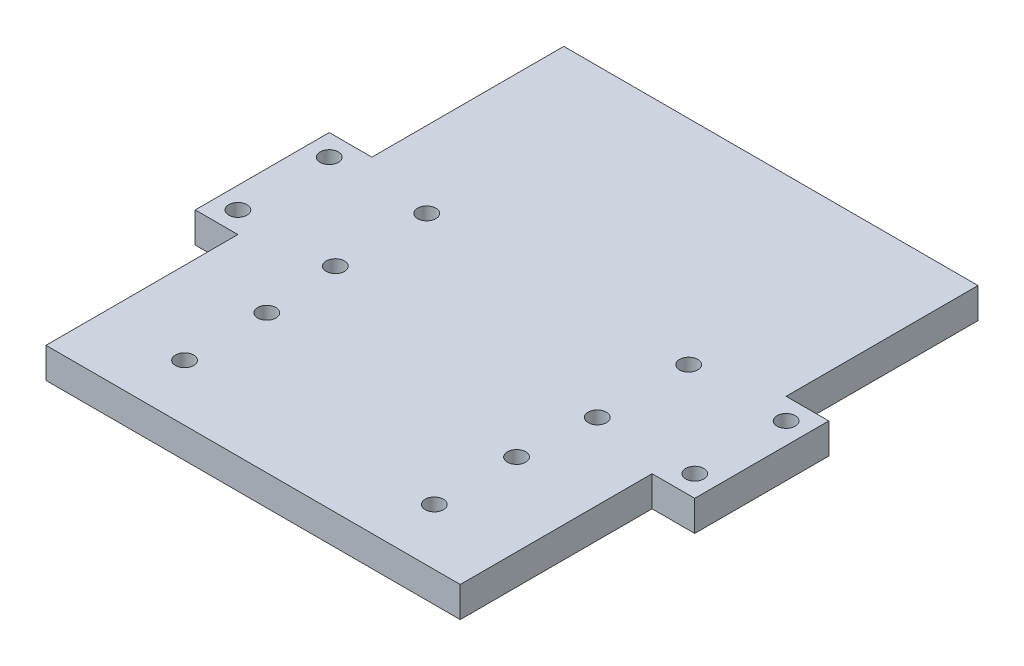
ISO-10303-21;
HEADER;
FILE_DESCRIPTION(('STEP AP214'),'2;1');
FILE_NAME('part.step','',(''),(''),'','','');
FILE_SCHEMA(('AUTOMOTIVE_DESIGN { 1 0 10303 214 1 1 1 1 }'));
ENDSEC;
DATA;
#1=APPLICATION_CONTEXT('core data for automotive mechanical design processes');
#2=APPLICATION_PROTOCOL_DEFINITION('international standard','automotive_design',2000,#1);
#3=PRODUCT_CONTEXT('',#1,'mechanical');
#4=PRODUCT('Part','Part','',(#3));
#5=PRODUCT_RELATED_PRODUCT_CATEGORY('part','',(#4));
#6=PRODUCT_DEFINITION_FORMATION('','',#4);
#7=PRODUCT_DEFINITION_CONTEXT('part definition',#1,'design');
#8=PRODUCT_DEFINITION('design','',#6,#7);
#9=PRODUCT_DEFINITION_SHAPE('','',#8);
#10=(LENGTH_UNIT() NAMED_UNIT(*) SI_UNIT(.MILLI.,.METRE.));
#11=(NAMED_UNIT(*) PLANE_ANGLE_UNIT() SI_UNIT($,.RADIAN.));
#12=(NAMED_UNIT(*) SI_UNIT($,.STERADIAN.) SOLID_ANGLE_UNIT());
#13=UNCERTAINTY_MEASURE_WITH_UNIT(LENGTH_MEASURE(1.E-05),#10,'distance_accuracy_value','');
#14=(GEOMETRIC_REPRESENTATION_CONTEXT(3) GLOBAL_UNCERTAINTY_ASSIGNED_CONTEXT((#13)) GLOBAL_UNIT_ASSIGNED_CONTEXT((#10,
#11,#12)) REPRESENTATION_CONTEXT('',''));
#15=CARTESIAN_POINT('',(0.,0.,0.));
#16=DIRECTION('',(0.,0.,1.));
#17=DIRECTION('',(1.,0.,0.));
#18=AXIS2_PLACEMENT_3D('',#15,#16,#17);
#19=CARTESIAN_POINT('',(0.,5.,0.));
#20=DIRECTION('',(0.,-1.,0.));
#21=DIRECTION('',(0.,0.,-1.));
#22=AXIS2_PLACEMENT_3D('',#19,#20,#21);
#23=PLANE('',#22);
#24=CARTESIAN_POINT('',(-20.5,5.,19.75));
#25=DIRECTION('',(0.,1.,0.));
#26=DIRECTION('',(0.,0.,1.));
#27=AXIS2_PLACEMENT_3D('',#24,#25,#26);
#28=CIRCLE('',#27,1.5);
#29=CARTESIAN_POINT('',(-20.5,5.,21.25));
#30=VERTEX_POINT('',#29);
#31=EDGE_CURVE('E368',#30,#30,#28,.T.);
#32=ORIENTED_EDGE('',*,*,#31,.F.);
#33=EDGE_LOOP('',(#32));
#34=FACE_BOUND('',#33,.T.);
#35=CARTESIAN_POINT('',(20.5,5.,33.25));
#36=DIRECTION('',(0.,1.,0.));
#37=DIRECTION('',(0.,0.,-1.));
#38=AXIS2_PLACEMENT_3D('',#35,#36,#37);
#39=CIRCLE('',#38,1.5);
#40=CARTESIAN_POINT('',(20.5,5.,31.75));
#41=VERTEX_POINT('',#40);
#42=EDGE_CURVE('E371',#41,#41,#39,.T.);
#43=ORIENTED_EDGE('',*,*,#42,.F.);
#44=EDGE_LOOP('',(#43));
#45=FACE_BOUND('',#44,.T.);
#46=CARTESIAN_POINT('',(20.5,5.,19.75));
#47=DIRECTION('',(0.,1.,0.));
#48=DIRECTION('',(0.,0.,-1.));
#49=AXIS2_PLACEMENT_3D('',#46,#47,#48);
#50=CIRCLE('',#49,1.5);
#51=CARTESIAN_POINT('',(20.5,5.,18.25));
#52=VERTEX_POINT('',#51);
#53=EDGE_CURVE('E377',#52,#52,#50,.T.);
#54=ORIENTED_EDGE('',*,*,#53,.F.);
#55=EDGE_LOOP('',(#54));
#56=FACE_BOUND('',#55,.T.);
#57=CARTESIAN_POINT('',(-20.5,5.,33.25));
#58=DIRECTION('',(0.,1.,0.));
#59=DIRECTION('',(0.,0.,1.));
#60=AXIS2_PLACEMENT_3D('',#57,#58,#59);
#61=CIRCLE('',#60,1.5);
#62=CARTESIAN_POINT('',(-20.5,5.,34.75));
#63=VERTEX_POINT('',#62);
#64=EDGE_CURVE('E173',#63,#63,#61,.T.);
#65=ORIENTED_EDGE('',*,*,#64,.F.);
#66=EDGE_LOOP('',(#65));
#67=FACE_BOUND('',#66,.T.);
#68=DIRECTION('',(-1.,0.,0.));
#69=VECTOR('',#68,1.);
#70=CARTESIAN_POINT('',(40.,5.,-11.));
#71=LINE('',#70,#69);
#72=CARTESIAN_POINT('',(41.,5.,-11.));
#73=VERTEX_POINT('',#72);
#74=CARTESIAN_POINT('',(34.,5.,-11.));
#75=VERTEX_POINT('',#74);
#76=EDGE_CURVE('E273',#73,#75,#71,.T.);
#77=ORIENTED_EDGE('',*,*,#76,.T.);
#78=DIRECTION('',(0.,0.,1.));
#79=VECTOR('',#78,1.);
#80=CARTESIAN_POINT('',(34.,5.,42.5));
#81=LINE('',#80,#79);
#82=CARTESIAN_POINT('',(34.,5.,-42.5));
#83=VERTEX_POINT('',#82);
#84=EDGE_CURVE('E63',#83,#75,#81,.T.);
#85=ORIENTED_EDGE('',*,*,#84,.F.);
#86=DIRECTION('',(-1.,0.,0.));
#87=VECTOR('',#86,1.);
#88=CARTESIAN_POINT('',(-33.,5.,-42.5));
#89=LINE('',#88,#87);
#90=CARTESIAN_POINT('',(-34.,5.,-42.5));
#91=VERTEX_POINT('',#90);
#92=EDGE_CURVE('E147',#83,#91,#89,.T.);
#93=ORIENTED_EDGE('',*,*,#92,.T.);
#94=DIRECTION('',(0.,0.,-1.));
#95=VECTOR('',#94,1.);
#96=CARTESIAN_POINT('',(-34.,5.,-42.5));
#97=LINE('',#96,#95);
#98=CARTESIAN_POINT('',(-34.,5.,-11.));
#99=VERTEX_POINT('',#98);
#100=EDGE_CURVE('E194',#99,#91,#97,.T.);
#101=ORIENTED_EDGE('',*,*,#100,.F.);
#102=DIRECTION('',(1.,0.,0.));
#103=VECTOR('',#102,1.);
#104=CARTESIAN_POINT('',(-40.,5.,-11.));
#105=LINE('',#104,#103);
#106=CARTESIAN_POINT('',(-41.,5.,-11.));
#107=VERTEX_POINT('',#106);
#108=EDGE_CURVE('E285',#107,#99,#105,.T.);
#109=ORIENTED_EDGE('',*,*,#108,.F.);
#110=DIRECTION('',(0.,0.,-1.));
#111=VECTOR('',#110,1.);
#112=CARTESIAN_POINT('',(-41.,5.,-11.));
#113=LINE('',#112,#111);
#114=CARTESIAN_POINT('',(-41.,5.,11.));
#115=VERTEX_POINT('',#114);
#116=EDGE_CURVE('E230',#115,#107,#113,.T.);
#117=ORIENTED_EDGE('',*,*,#116,.F.);
#118=DIRECTION('',(1.,0.,0.));
#119=VECTOR('',#118,1.);
#120=CARTESIAN_POINT('',(-40.,5.,11.));
#121=LINE('',#120,#119);
#122=CARTESIAN_POINT('',(-34.,5.,11.));
#123=VERTEX_POINT('',#122);
#124=EDGE_CURVE('E288',#115,#123,#121,.T.);
#125=ORIENTED_EDGE('',*,*,#124,.T.);
#126=CARTESIAN_POINT('',(-34.,5.,42.5));
#127=VERTEX_POINT('',#126);
#128=EDGE_CURVE('E195',#127,#123,#97,.T.);
#129=ORIENTED_EDGE('',*,*,#128,.F.);
#130=DIRECTION('',(1.,0.,0.));
#131=VECTOR('',#130,1.);
#132=CARTESIAN_POINT('',(-33.,5.,42.5));
#133=LINE('',#132,#131);
#134=CARTESIAN_POINT('',(34.,5.,42.5));
#135=VERTEX_POINT('',#134);
#136=EDGE_CURVE('E298',#127,#135,#133,.T.);
#137=ORIENTED_EDGE('',*,*,#136,.T.);
#138=CARTESIAN_POINT('',(34.,5.,11.));
#139=VERTEX_POINT('',#138);
#140=EDGE_CURVE('E164',#139,#135,#81,.T.);
#141=ORIENTED_EDGE('',*,*,#140,.F.);
#142=DIRECTION('',(-1.,0.,0.));
#143=VECTOR('',#142,1.);
#144=CARTESIAN_POINT('',(40.,5.,11.));
#145=LINE('',#144,#143);
#146=CARTESIAN_POINT('',(41.,5.,11.));
#147=VERTEX_POINT('',#146);
#148=EDGE_CURVE('E269',#147,#139,#145,.T.);
#149=ORIENTED_EDGE('',*,*,#148,.F.);
#150=DIRECTION('',(0.,0.,1.));
#151=VECTOR('',#150,1.);
#152=CARTESIAN_POINT('',(41.,5.,11.));
#153=LINE('',#152,#151);
#154=EDGE_CURVE('E214',#73,#147,#153,.T.);
#155=ORIENTED_EDGE('',*,*,#154,.F.);
#156=EDGE_LOOP('',(#77,#85,#93,#101,#109,#117,#125,#129,#137,#141,#149,#155));
#157=FACE_BOUND('',#156,.T.);
#158=CARTESIAN_POINT('',(37.5,5.,7.49999999999999));
#159=DIRECTION('',(0.,-1.,0.));
#160=DIRECTION('',(0.,0.,-1.));
#161=AXIS2_PLACEMENT_3D('',#158,#159,#160);
#162=CIRCLE('',#161,1.5);
#163=CARTESIAN_POINT('',(37.5,5.,5.99999999999999));
#164=VERTEX_POINT('',#163);
#165=EDGE_CURVE('E234',#164,#164,#162,.T.);
#166=ORIENTED_EDGE('',*,*,#165,.T.);
#167=EDGE_LOOP('',(#166));
#168=FACE_BOUND('',#167,.T.);
#169=CARTESIAN_POINT('',(37.5,5.,-7.50000000000001));
#170=DIRECTION('',(0.,-1.,0.));
#171=DIRECTION('',(0.,0.,-1.));
#172=AXIS2_PLACEMENT_3D('',#169,#170,#171);
#173=CIRCLE('',#172,1.5);
#174=CARTESIAN_POINT('',(37.5,5.,-9.00000000000001));
#175=VERTEX_POINT('',#174);
#176=EDGE_CURVE('E238',#175,#175,#173,.T.);
#177=ORIENTED_EDGE('',*,*,#176,.T.);
#178=EDGE_LOOP('',(#177));
#179=FACE_BOUND('',#178,.T.);
#180=CARTESIAN_POINT('',(-21.5,5.,7.5));
#181=DIRECTION('',(0.,1.,0.));
#182=DIRECTION('',(0.,0.,1.));
#183=AXIS2_PLACEMENT_3D('',#180,#181,#182);
#184=CIRCLE('',#183,1.5);
#185=CARTESIAN_POINT('',(-21.5,5.,9.));
#186=VERTEX_POINT('',#185);
#187=EDGE_CURVE('E247',#186,#186,#184,.T.);
#188=ORIENTED_EDGE('',*,*,#187,.F.);
#189=EDGE_LOOP('',(#188));
#190=FACE_BOUND('',#189,.T.);
#191=CARTESIAN_POINT('',(-21.5,5.,-7.5));
#192=DIRECTION('',(0.,1.,0.));
#193=DIRECTION('',(0.,0.,1.));
#194=AXIS2_PLACEMENT_3D('',#191,#192,#193);
#195=CIRCLE('',#194,1.5);
#196=CARTESIAN_POINT('',(-21.5,5.,-6.));
#197=VERTEX_POINT('',#196);
#198=EDGE_CURVE('E255',#197,#197,#195,.T.);
#199=ORIENTED_EDGE('',*,*,#198,.F.);
#200=EDGE_LOOP('',(#199));
#201=FACE_BOUND('',#200,.T.);
#202=CARTESIAN_POINT('',(21.5,5.,7.49999999999999));
#203=DIRECTION('',(0.,-1.,0.));
#204=DIRECTION('',(0.,0.,-1.));
#205=AXIS2_PLACEMENT_3D('',#202,#203,#204);
#206=CIRCLE('',#205,1.5);
#207=CARTESIAN_POINT('',(21.5,5.,5.99999999999999));
#208=VERTEX_POINT('',#207);
#209=EDGE_CURVE('E239',#208,#208,#206,.T.);
#210=ORIENTED_EDGE('',*,*,#209,.T.);
#211=EDGE_LOOP('',(#210));
#212=FACE_BOUND('',#211,.T.);
#213=CARTESIAN_POINT('',(21.5,5.,-7.50000000000001));
#214=DIRECTION('',(0.,-1.,0.));
#215=DIRECTION('',(0.,0.,-1.));
#216=AXIS2_PLACEMENT_3D('',#213,#214,#215);
#217=CIRCLE('',#216,1.5);
#218=CARTESIAN_POINT('',(21.5,5.,-9.00000000000001));
#219=VERTEX_POINT('',#218);
#220=EDGE_CURVE('E243',#219,#219,#217,.T.);
#221=ORIENTED_EDGE('',*,*,#220,.T.);
#222=EDGE_LOOP('',(#221));
#223=FACE_BOUND('',#222,.T.);
#224=CARTESIAN_POINT('',(-37.5,5.,-7.5));
#225=DIRECTION('',(0.,1.,0.));
#226=DIRECTION('',(0.,0.,1.));
#227=AXIS2_PLACEMENT_3D('',#224,#225,#226);
#228=CIRCLE('',#227,1.5);
#229=CARTESIAN_POINT('',(-37.5,5.,-6.));
#230=VERTEX_POINT('',#229);
#231=EDGE_CURVE('E259',#230,#230,#228,.T.);
#232=ORIENTED_EDGE('',*,*,#231,.F.);
#233=EDGE_LOOP('',(#232));
#234=FACE_BOUND('',#233,.T.);
#235=CARTESIAN_POINT('',(-37.5,5.,7.5));
#236=DIRECTION('',(0.,1.,0.));
#237=DIRECTION('',(0.,0.,1.));
#238=AXIS2_PLACEMENT_3D('',#235,#236,#237);
#239=CIRCLE('',#238,1.5);
#240=CARTESIAN_POINT('',(-37.5,5.,9.00000000000001));
#241=VERTEX_POINT('',#240);
#242=EDGE_CURVE('E251',#241,#241,#239,.T.);
#243=ORIENTED_EDGE('',*,*,#242,.F.);
#244=EDGE_LOOP('',(#243));
#245=FACE_BOUND('',#244,.T.);
#246=ADVANCED_FACE('F45',(#34,#45,#56,#67,#157,#168,#179,#190,#201,#212,#223,#234,#245),#23,.F.);
#247=CARTESIAN_POINT('',(0.,0.,0.));
#248=DIRECTION('',(0.,-1.,0.));
#249=DIRECTION('',(0.,0.,-1.));
#250=AXIS2_PLACEMENT_3D('',#247,#248,#249);
#251=PLANE('',#250);
#252=CARTESIAN_POINT('',(-20.5,0.,19.75));
#253=DIRECTION('',(0.,-1.,0.));
#254=DIRECTION('',(0.,0.,-1.));
#255=AXIS2_PLACEMENT_3D('',#252,#253,#254);
#256=CIRCLE('',#255,1.5);
#257=CARTESIAN_POINT('',(-20.5,0.,18.25));
#258=VERTEX_POINT('',#257);
#259=EDGE_CURVE('E49',#258,#258,#256,.T.);
#260=ORIENTED_EDGE('',*,*,#259,.F.);
#261=EDGE_LOOP('',(#260));
#262=FACE_BOUND('',#261,.T.);
#263=CARTESIAN_POINT('',(20.5,0.,33.25));
#264=DIRECTION('',(0.,-1.,0.));
#265=DIRECTION('',(0.,0.,-1.));
#266=AXIS2_PLACEMENT_3D('',#263,#264,#265);
#267=CIRCLE('',#266,1.5);
#268=CARTESIAN_POINT('',(20.5,0.,31.75));
#269=VERTEX_POINT('',#268);
#270=EDGE_CURVE('E171',#269,#269,#267,.T.);
#271=ORIENTED_EDGE('',*,*,#270,.F.);
#272=EDGE_LOOP('',(#271));
#273=FACE_BOUND('',#272,.T.);
#274=CARTESIAN_POINT('',(20.5,0.,19.75));
#275=DIRECTION('',(0.,-1.,0.));
#276=DIRECTION('',(0.,0.,-1.));
#277=AXIS2_PLACEMENT_3D('',#274,#275,#276);
#278=CIRCLE('',#277,1.5);
#279=CARTESIAN_POINT('',(20.5,0.,18.25));
#280=VERTEX_POINT('',#279);
#281=EDGE_CURVE('E340',#280,#280,#278,.T.);
#282=ORIENTED_EDGE('',*,*,#281,.F.);
#283=EDGE_LOOP('',(#282));
#284=FACE_BOUND('',#283,.T.);
#285=CARTESIAN_POINT('',(-20.5,0.,33.25));
#286=DIRECTION('',(0.,-1.,0.));
#287=DIRECTION('',(0.,0.,-1.));
#288=AXIS2_PLACEMENT_3D('',#285,#286,#287);
#289=CIRCLE('',#288,1.5);
#290=CARTESIAN_POINT('',(-20.5,0.,31.75));
#291=VERTEX_POINT('',#290);
#292=EDGE_CURVE('E336',#291,#291,#289,.T.);
#293=ORIENTED_EDGE('',*,*,#292,.F.);
#294=EDGE_LOOP('',(#293));
#295=FACE_BOUND('',#294,.T.);
#296=DIRECTION('',(-1.,0.,0.));
#297=VECTOR('',#296,1.);
#298=CARTESIAN_POINT('',(40.,0.,11.));
#299=LINE('',#298,#297);
#300=CARTESIAN_POINT('',(41.,0.,11.));
#301=VERTEX_POINT('',#300);
#302=CARTESIAN_POINT('',(34.,0.,11.));
#303=VERTEX_POINT('',#302);
#304=EDGE_CURVE('E155',#301,#303,#299,.T.);
#305=ORIENTED_EDGE('',*,*,#304,.T.);
#306=DIRECTION('',(0.,0.,-1.));
#307=VECTOR('',#306,1.);
#308=CARTESIAN_POINT('',(34.,0.,42.5));
#309=LINE('',#308,#307);
#310=CARTESIAN_POINT('',(34.,0.,42.5));
#311=VERTEX_POINT('',#310);
#312=EDGE_CURVE('E151',#311,#303,#309,.T.);
#313=ORIENTED_EDGE('',*,*,#312,.F.);
#314=DIRECTION('',(1.,0.,0.));
#315=VECTOR('',#314,1.);
#316=CARTESIAN_POINT('',(-33.,0.,42.5));
#317=LINE('',#316,#315);
#318=CARTESIAN_POINT('',(-34.,0.,42.5));
#319=VERTEX_POINT('',#318);
#320=EDGE_CURVE('E136',#319,#311,#317,.T.);
#321=ORIENTED_EDGE('',*,*,#320,.F.);
#322=DIRECTION('',(0.,0.,1.));
#323=VECTOR('',#322,1.);
#324=CARTESIAN_POINT('',(-34.,0.,-42.5));
#325=LINE('',#324,#323);
#326=CARTESIAN_POINT('',(-34.,0.,11.));
#327=VERTEX_POINT('',#326);
#328=EDGE_CURVE('E187',#327,#319,#325,.T.);
#329=ORIENTED_EDGE('',*,*,#328,.F.);
#330=DIRECTION('',(1.,0.,0.));
#331=VECTOR('',#330,1.);
#332=CARTESIAN_POINT('',(-40.,0.,11.));
#333=LINE('',#332,#331);
#334=CARTESIAN_POINT('',(-41.,0.,11.));
#335=VERTEX_POINT('',#334);
#336=EDGE_CURVE('E292',#335,#327,#333,.T.);
#337=ORIENTED_EDGE('',*,*,#336,.F.);
#338=DIRECTION('',(0.,0.,1.));
#339=VECTOR('',#338,1.);
#340=CARTESIAN_POINT('',(-41.,0.,-11.));
#341=LINE('',#340,#339);
#342=CARTESIAN_POINT('',(-41.,0.,-11.));
#343=VERTEX_POINT('',#342);
#344=EDGE_CURVE('E222',#343,#335,#341,.T.);
#345=ORIENTED_EDGE('',*,*,#344,.F.);
#346=DIRECTION('',(1.,0.,0.));
#347=VECTOR('',#346,1.);
#348=CARTESIAN_POINT('',(-40.,0.,-11.));
#349=LINE('',#348,#347);
#350=CARTESIAN_POINT('',(-34.,0.,-11.));
#351=VERTEX_POINT('',#350);
#352=EDGE_CURVE('E281',#343,#351,#349,.T.);
#353=ORIENTED_EDGE('',*,*,#352,.T.);
#354=CARTESIAN_POINT('',(-34.,0.,-42.5));
#355=VERTEX_POINT('',#354);
#356=EDGE_CURVE('E188',#355,#351,#325,.T.);
#357=ORIENTED_EDGE('',*,*,#356,.F.);
#358=DIRECTION('',(-1.,0.,0.));
#359=VECTOR('',#358,1.);
#360=CARTESIAN_POINT('',(-33.,0.,-42.5));
#361=LINE('',#360,#359);
#362=CARTESIAN_POINT('',(34.,0.,-42.5));
#363=VERTEX_POINT('',#362);
#364=EDGE_CURVE('E148',#363,#355,#361,.T.);
#365=ORIENTED_EDGE('',*,*,#364,.F.);
#366=CARTESIAN_POINT('',(34.,0.,-11.));
#367=VERTEX_POINT('',#366);
#368=EDGE_CURVE('E159',#367,#363,#309,.T.);
#369=ORIENTED_EDGE('',*,*,#368,.F.);
#370=DIRECTION('',(-1.,0.,0.));
#371=VECTOR('',#370,1.);
#372=CARTESIAN_POINT('',(40.,0.,-11.));
#373=LINE('',#372,#371);
#374=CARTESIAN_POINT('',(41.,0.,-11.));
#375=VERTEX_POINT('',#374);
#376=EDGE_CURVE('E277',#375,#367,#373,.T.);
#377=ORIENTED_EDGE('',*,*,#376,.F.);
#378=DIRECTION('',(0.,0.,-1.));
#379=VECTOR('',#378,1.);
#380=CARTESIAN_POINT('',(41.,0.,11.));
#381=LINE('',#380,#379);
#382=EDGE_CURVE('E206',#301,#375,#381,.T.);
#383=ORIENTED_EDGE('',*,*,#382,.F.);
#384=EDGE_LOOP('',(#305,#313,#321,#329,#337,#345,#353,#357,#365,#369,#377,#383));
#385=FACE_BOUND('',#384,.T.);
#386=CARTESIAN_POINT('',(37.5,0.,-7.50000000000001));
#387=DIRECTION('',(0.,-1.,0.));
#388=DIRECTION('',(0.,0.,-1.));
#389=AXIS2_PLACEMENT_3D('',#386,#387,#388);
#390=CIRCLE('',#389,1.5);
#391=CARTESIAN_POINT('',(37.5,0.,-9.00000000000001));
#392=VERTEX_POINT('',#391);
#393=EDGE_CURVE('E310',#392,#392,#390,.F.);
#394=ORIENTED_EDGE('',*,*,#393,.T.);
#395=EDGE_LOOP('',(#394));
#396=FACE_BOUND('',#395,.T.);
#397=CARTESIAN_POINT('',(37.5,0.,7.49999999999999));
#398=DIRECTION('',(0.,-1.,0.));
#399=DIRECTION('',(0.,0.,-1.));
#400=AXIS2_PLACEMENT_3D('',#397,#398,#399);
#401=CIRCLE('',#400,1.5);
#402=CARTESIAN_POINT('',(37.5,0.,5.99999999999999));
#403=VERTEX_POINT('',#402);
#404=EDGE_CURVE('E314',#403,#403,#401,.F.);
#405=ORIENTED_EDGE('',*,*,#404,.T.);
#406=EDGE_LOOP('',(#405));
#407=FACE_BOUND('',#406,.T.);
#408=CARTESIAN_POINT('',(21.5,0.,7.49999999999999));
#409=DIRECTION('',(0.,-1.,0.));
#410=DIRECTION('',(0.,0.,-1.));
#411=AXIS2_PLACEMENT_3D('',#408,#409,#410);
#412=CIRCLE('',#411,1.5);
#413=CARTESIAN_POINT('',(21.5,0.,5.99999999999999));
#414=VERTEX_POINT('',#413);
#415=EDGE_CURVE('E306',#414,#414,#412,.F.);
#416=ORIENTED_EDGE('',*,*,#415,.T.);
#417=EDGE_LOOP('',(#416));
#418=FACE_BOUND('',#417,.T.);
#419=CARTESIAN_POINT('',(-21.5,0.,-7.5));
#420=DIRECTION('',(0.,-1.,0.));
#421=DIRECTION('',(0.,0.,-1.));
#422=AXIS2_PLACEMENT_3D('',#419,#420,#421);
#423=CIRCLE('',#422,1.5);
#424=CARTESIAN_POINT('',(-21.5,0.,-9.));
#425=VERTEX_POINT('',#424);
#426=EDGE_CURVE('E318',#425,#425,#423,.T.);
#427=ORIENTED_EDGE('',*,*,#426,.F.);
#428=EDGE_LOOP('',(#427));
#429=FACE_BOUND('',#428,.T.);
#430=CARTESIAN_POINT('',(-21.5,0.,7.5));
#431=DIRECTION('',(0.,-1.,0.));
#432=DIRECTION('',(0.,0.,-1.));
#433=AXIS2_PLACEMENT_3D('',#430,#431,#432);
#434=CIRCLE('',#433,1.5);
#435=CARTESIAN_POINT('',(-21.5,0.,6.));
#436=VERTEX_POINT('',#435);
#437=EDGE_CURVE('E326',#436,#436,#434,.T.);
#438=ORIENTED_EDGE('',*,*,#437,.F.);
#439=EDGE_LOOP('',(#438));
#440=FACE_BOUND('',#439,.T.);
#441=CARTESIAN_POINT('',(21.5,0.,-7.50000000000001));
#442=DIRECTION('',(0.,-1.,0.));
#443=DIRECTION('',(0.,0.,-1.));
#444=AXIS2_PLACEMENT_3D('',#441,#442,#443);
#445=CIRCLE('',#444,1.5);
#446=CARTESIAN_POINT('',(21.5,0.,-9.00000000000001));
#447=VERTEX_POINT('',#446);
#448=EDGE_CURVE('E270',#447,#447,#445,.F.);
#449=ORIENTED_EDGE('',*,*,#448,.T.);
#450=EDGE_LOOP('',(#449));
#451=FACE_BOUND('',#450,.T.);
#452=CARTESIAN_POINT('',(-37.5,0.,7.5));
#453=DIRECTION('',(0.,-1.,0.));
#454=DIRECTION('',(0.,0.,-1.));
#455=AXIS2_PLACEMENT_3D('',#452,#453,#454);
#456=CIRCLE('',#455,1.5);
#457=CARTESIAN_POINT('',(-37.5,0.,6.));
#458=VERTEX_POINT('',#457);
#459=EDGE_CURVE('E322',#458,#458,#456,.T.);
#460=ORIENTED_EDGE('',*,*,#459,.F.);
#461=EDGE_LOOP('',(#460));
#462=FACE_BOUND('',#461,.T.);
#463=CARTESIAN_POINT('',(-37.5,0.,-7.5));
#464=DIRECTION('',(0.,-1.,0.));
#465=DIRECTION('',(0.,0.,-1.));
#466=AXIS2_PLACEMENT_3D('',#463,#464,#465);
#467=CIRCLE('',#466,1.5);
#468=CARTESIAN_POINT('',(-37.5,0.,-9.00000000000001));
#469=VERTEX_POINT('',#468);
#470=EDGE_CURVE('E266',#469,#469,#467,.T.);
#471=ORIENTED_EDGE('',*,*,#470,.F.);
#472=EDGE_LOOP('',(#471));
#473=FACE_BOUND('',#472,.T.);
#474=ADVANCED_FACE('F152',(#262,#273,#284,#295,#385,#396,#407,#418,#429,#440,#451,#462,#473),
#251,.T.);
#475=CARTESIAN_POINT('',(-33.,5.,-42.5));
#476=DIRECTION('',(0.,0.,1.));
#477=DIRECTION('',(1.,0.,0.));
#478=AXIS2_PLACEMENT_3D('',#475,#476,#477);
#479=PLANE('',#478);
#480=ORIENTED_EDGE('',*,*,#364,.T.);
#481=DIRECTION('',(0.,-1.,0.));
#482=VECTOR('',#481,1.);
#483=CARTESIAN_POINT('',(-34.,5.,-42.5));
#484=LINE('',#483,#482);
#485=EDGE_CURVE('E183',#91,#355,#484,.T.);
#486=ORIENTED_EDGE('',*,*,#485,.F.);
#487=ORIENTED_EDGE('',*,*,#92,.F.);
#488=DIRECTION('',(0.,1.,0.));
#489=VECTOR('',#488,1.);
#490=CARTESIAN_POINT('',(34.,5.,-42.5));
#491=LINE('',#490,#489);
#492=EDGE_CURVE('E158',#363,#83,#491,.T.);
#493=ORIENTED_EDGE('',*,*,#492,.F.);
#494=EDGE_LOOP('',(#480,#486,#487,#493));
#495=FACE_BOUND('',#494,.T.);
#496=ADVANCED_FACE('F47',(#495),#479,.F.);
#497=CARTESIAN_POINT('',(-33.,5.,42.5));
#498=DIRECTION('',(0.,0.,-1.));
#499=DIRECTION('',(-1.,0.,0.));
#500=AXIS2_PLACEMENT_3D('',#497,#498,#499);
#501=PLANE('',#500);
#502=ORIENTED_EDGE('',*,*,#320,.T.);
#503=DIRECTION('',(0.,-1.,0.));
#504=VECTOR('',#503,1.);
#505=CARTESIAN_POINT('',(34.,5.,42.5));
#506=LINE('',#505,#504);
#507=EDGE_CURVE('E140',#135,#311,#506,.T.);
#508=ORIENTED_EDGE('',*,*,#507,.F.);
#509=ORIENTED_EDGE('',*,*,#136,.F.);
#510=DIRECTION('',(0.,1.,0.));
#511=VECTOR('',#510,1.);
#512=CARTESIAN_POINT('',(-34.,5.,42.5));
#513=LINE('',#512,#511);
#514=EDGE_CURVE('E142',#319,#127,#513,.T.);
#515=ORIENTED_EDGE('',*,*,#514,.F.);
#516=EDGE_LOOP('',(#502,#508,#509,#515));
#517=FACE_BOUND('',#516,.T.);
#518=ADVANCED_FACE('F138',(#517),#501,.F.);
#519=CARTESIAN_POINT('',(-40.,0.,11.));
#520=DIRECTION('',(0.,0.,-1.));
#521=DIRECTION('',(0.,1.,0.));
#522=AXIS2_PLACEMENT_3D('',#519,#520,#521);
#523=PLANE('',#522);
#524=ORIENTED_EDGE('',*,*,#336,.T.);
#525=DIRECTION('',(0.,1.,0.));
#526=VECTOR('',#525,1.);
#527=CARTESIAN_POINT('',(-34.,0.,11.));
#528=LINE('',#527,#526);
#529=EDGE_CURVE('E198',#327,#123,#528,.T.);
#530=ORIENTED_EDGE('',*,*,#529,.T.);
#531=ORIENTED_EDGE('',*,*,#124,.F.);
#532=DIRECTION('',(0.,1.,0.));
#533=VECTOR('',#532,1.);
#534=CARTESIAN_POINT('',(-41.,5.,11.));
#535=LINE('',#534,#533);
#536=EDGE_CURVE('E226',#335,#115,#535,.T.);
#537=ORIENTED_EDGE('',*,*,#536,.F.);
#538=EDGE_LOOP('',(#524,#530,#531,#537));
#539=FACE_BOUND('',#538,.T.);
#540=ADVANCED_FACE('F439',(#539),#523,.F.);
#541=CARTESIAN_POINT('',(-40.,0.,-11.));
#542=DIRECTION('',(0.,0.,-1.));
#543=DIRECTION('',(-1.,0.,0.));
#544=AXIS2_PLACEMENT_3D('',#541,#542,#543);
#545=PLANE('',#544);
#546=DIRECTION('',(0.,1.,0.));
#547=VECTOR('',#546,1.);
#548=CARTESIAN_POINT('',(-34.,0.,-11.));
#549=LINE('',#548,#547);
#550=EDGE_CURVE('E55',#351,#99,#549,.T.);
#551=ORIENTED_EDGE('',*,*,#550,.F.);
#552=ORIENTED_EDGE('',*,*,#352,.F.);
#553=DIRECTION('',(0.,-1.,0.));
#554=VECTOR('',#553,1.);
#555=CARTESIAN_POINT('',(-41.,5.,-11.));
#556=LINE('',#555,#554);
#557=EDGE_CURVE('E218',#107,#343,#556,.T.);
#558=ORIENTED_EDGE('',*,*,#557,.F.);
#559=ORIENTED_EDGE('',*,*,#108,.T.);
#560=EDGE_LOOP('',(#551,#552,#558,#559));
#561=FACE_BOUND('',#560,.T.);
#562=ADVANCED_FACE('F435',(#561),#545,.T.);
#563=CARTESIAN_POINT('',(40.,0.,-11.));
#564=DIRECTION('',(0.,0.,1.));
#565=DIRECTION('',(1.,0.,0.));
#566=AXIS2_PLACEMENT_3D('',#563,#564,#565);
#567=PLANE('',#566);
#568=ORIENTED_EDGE('',*,*,#376,.T.);
#569=DIRECTION('',(0.,1.,0.));
#570=VECTOR('',#569,1.);
#571=CARTESIAN_POINT('',(34.,0.,-11.));
#572=LINE('',#571,#570);
#573=EDGE_CURVE('E180',#367,#75,#572,.T.);
#574=ORIENTED_EDGE('',*,*,#573,.T.);
#575=ORIENTED_EDGE('',*,*,#76,.F.);
#576=DIRECTION('',(0.,1.,0.));
#577=VECTOR('',#576,1.);
#578=CARTESIAN_POINT('',(41.,5.,-11.));
#579=LINE('',#578,#577);
#580=EDGE_CURVE('E210',#375,#73,#579,.T.);
#581=ORIENTED_EDGE('',*,*,#580,.F.);
#582=EDGE_LOOP('',(#568,#574,#575,#581));
#583=FACE_BOUND('',#582,.T.);
#584=ADVANCED_FACE('F432',(#583),#567,.F.);
#585=CARTESIAN_POINT('',(40.,0.,11.));
#586=DIRECTION('',(0.,0.,1.));
#587=DIRECTION('',(0.,-1.,0.));
#588=AXIS2_PLACEMENT_3D('',#585,#586,#587);
#589=PLANE('',#588);
#590=DIRECTION('',(0.,1.,0.));
#591=VECTOR('',#590,1.);
#592=CARTESIAN_POINT('',(34.,0.,11.));
#593=LINE('',#592,#591);
#594=EDGE_CURVE('E11',#303,#139,#593,.T.);
#595=ORIENTED_EDGE('',*,*,#594,.F.);
#596=ORIENTED_EDGE('',*,*,#304,.F.);
#597=DIRECTION('',(0.,-1.,0.));
#598=VECTOR('',#597,1.);
#599=CARTESIAN_POINT('',(41.,5.,11.));
#600=LINE('',#599,#598);
#601=EDGE_CURVE('E202',#147,#301,#600,.T.);
#602=ORIENTED_EDGE('',*,*,#601,.F.);
#603=ORIENTED_EDGE('',*,*,#148,.T.);
#604=EDGE_LOOP('',(#595,#596,#602,#603));
#605=FACE_BOUND('',#604,.T.);
#606=ADVANCED_FACE('F428',(#605),#589,.T.);
#607=CARTESIAN_POINT('',(-37.5,-5.,-7.5));
#608=DIRECTION('',(0.,1.,0.));
#609=DIRECTION('',(0.,0.,1.));
#610=AXIS2_PLACEMENT_3D('',#607,#608,#609);
#611=CYLINDRICAL_SURFACE('',#610,1.5);
#612=ORIENTED_EDGE('',*,*,#470,.T.);
#613=EDGE_LOOP('',(#612));
#614=FACE_BOUND('',#613,.T.);
#615=ORIENTED_EDGE('',*,*,#231,.T.);
#616=EDGE_LOOP('',(#615));
#617=FACE_BOUND('',#616,.T.);
#618=ADVANCED_FACE('F424',(#614,#617),#611,.F.);
#619=CARTESIAN_POINT('',(21.5,-5.,7.49999999999999));
#620=DIRECTION('',(0.,1.,0.));
#621=DIRECTION('',(0.,0.,1.));
#622=AXIS2_PLACEMENT_3D('',#619,#620,#621);
#623=CYLINDRICAL_SURFACE('',#622,1.5);
#624=ORIENTED_EDGE('',*,*,#415,.F.);
#625=EDGE_LOOP('',(#624));
#626=FACE_BOUND('',#625,.T.);
#627=ORIENTED_EDGE('',*,*,#209,.F.);
#628=EDGE_LOOP('',(#627));
#629=FACE_BOUND('',#628,.T.);
#630=ADVANCED_FACE('F427',(#626,#629),#623,.F.);
#631=CARTESIAN_POINT('',(37.5,-5.,-7.50000000000001));
#632=DIRECTION('',(0.,1.,0.));
#633=DIRECTION('',(0.,0.,1.));
#634=AXIS2_PLACEMENT_3D('',#631,#632,#633);
#635=CYLINDRICAL_SURFACE('',#634,1.5);
#636=ORIENTED_EDGE('',*,*,#393,.F.);
#637=EDGE_LOOP('',(#636));
#638=FACE_BOUND('',#637,.T.);
#639=ORIENTED_EDGE('',*,*,#176,.F.);
#640=EDGE_LOOP('',(#639));
#641=FACE_BOUND('',#640,.T.);
#642=ADVANCED_FACE('F489',(#638,#641),#635,.F.);
#643=CARTESIAN_POINT('',(37.5,-5.,7.49999999999999));
#644=DIRECTION('',(0.,1.,0.));
#645=DIRECTION('',(0.,0.,1.));
#646=AXIS2_PLACEMENT_3D('',#643,#644,#645);
#647=CYLINDRICAL_SURFACE('',#646,1.5);
#648=ORIENTED_EDGE('',*,*,#404,.F.);
#649=EDGE_LOOP('',(#648));
#650=FACE_BOUND('',#649,.T.);
#651=ORIENTED_EDGE('',*,*,#165,.F.);
#652=EDGE_LOOP('',(#651));
#653=FACE_BOUND('',#652,.T.);
#654=ADVANCED_FACE('F419',(#650,#653),#647,.F.);
#655=CARTESIAN_POINT('',(-21.5,-5.,-7.5));
#656=DIRECTION('',(0.,1.,0.));
#657=DIRECTION('',(0.,0.,1.));
#658=AXIS2_PLACEMENT_3D('',#655,#656,#657);
#659=CYLINDRICAL_SURFACE('',#658,1.5);
#660=ORIENTED_EDGE('',*,*,#426,.T.);
#661=EDGE_LOOP('',(#660));
#662=FACE_BOUND('',#661,.T.);
#663=ORIENTED_EDGE('',*,*,#198,.T.);
#664=EDGE_LOOP('',(#663));
#665=FACE_BOUND('',#664,.T.);
#666=ADVANCED_FACE('F409',(#662,#665),#659,.F.);
#667=CARTESIAN_POINT('',(-37.5,-5.,7.5));
#668=DIRECTION('',(0.,1.,0.));
#669=DIRECTION('',(0.,0.,1.));
#670=AXIS2_PLACEMENT_3D('',#667,#668,#669);
#671=CYLINDRICAL_SURFACE('',#670,1.5);
#672=ORIENTED_EDGE('',*,*,#459,.T.);
#673=EDGE_LOOP('',(#672));
#674=FACE_BOUND('',#673,.T.);
#675=ORIENTED_EDGE('',*,*,#242,.T.);
#676=EDGE_LOOP('',(#675));
#677=FACE_BOUND('',#676,.T.);
#678=ADVANCED_FACE('F406',(#674,#677),#671,.F.);
#679=CARTESIAN_POINT('',(-21.5,-5.,7.5));
#680=DIRECTION('',(0.,1.,0.));
#681=DIRECTION('',(0.,0.,1.));
#682=AXIS2_PLACEMENT_3D('',#679,#680,#681);
#683=CYLINDRICAL_SURFACE('',#682,1.5);
#684=ORIENTED_EDGE('',*,*,#437,.T.);
#685=EDGE_LOOP('',(#684));
#686=FACE_BOUND('',#685,.T.);
#687=ORIENTED_EDGE('',*,*,#187,.T.);
#688=EDGE_LOOP('',(#687));
#689=FACE_BOUND('',#688,.T.);
#690=ADVANCED_FACE('F408',(#686,#689),#683,.F.);
#691=CARTESIAN_POINT('',(21.5,-5.,-7.50000000000001));
#692=DIRECTION('',(0.,1.,0.));
#693=DIRECTION('',(0.,0.,1.));
#694=AXIS2_PLACEMENT_3D('',#691,#692,#693);
#695=CYLINDRICAL_SURFACE('',#694,1.5);
#696=ORIENTED_EDGE('',*,*,#448,.F.);
#697=EDGE_LOOP('',(#696));
#698=FACE_BOUND('',#697,.T.);
#699=ORIENTED_EDGE('',*,*,#220,.F.);
#700=EDGE_LOOP('',(#699));
#701=FACE_BOUND('',#700,.T.);
#702=ADVANCED_FACE('F416',(#698,#701),#695,.F.);
#703=CARTESIAN_POINT('',(-41.,0.,0.));
#704=DIRECTION('',(-1.,0.,0.));
#705=DIRECTION('',(0.,0.,1.));
#706=AXIS2_PLACEMENT_3D('',#703,#704,#705);
#707=PLANE('',#706);
#708=ORIENTED_EDGE('',*,*,#557,.T.);
#709=ORIENTED_EDGE('',*,*,#344,.T.);
#710=ORIENTED_EDGE('',*,*,#536,.T.);
#711=ORIENTED_EDGE('',*,*,#116,.T.);
#712=EDGE_LOOP('',(#708,#709,#710,#711));
#713=FACE_BOUND('',#712,.T.);
#714=ADVANCED_FACE('F468',(#713),#707,.T.);
#715=CARTESIAN_POINT('',(41.,0.,0.));
#716=DIRECTION('',(1.,0.,0.));
#717=DIRECTION('',(0.,0.,-1.));
#718=AXIS2_PLACEMENT_3D('',#715,#716,#717);
#719=PLANE('',#718);
#720=ORIENTED_EDGE('',*,*,#601,.T.);
#721=ORIENTED_EDGE('',*,*,#382,.T.);
#722=ORIENTED_EDGE('',*,*,#580,.T.);
#723=ORIENTED_EDGE('',*,*,#154,.T.);
#724=EDGE_LOOP('',(#720,#721,#722,#723));
#725=FACE_BOUND('',#724,.T.);
#726=ADVANCED_FACE('F472',(#725),#719,.T.);
#727=CARTESIAN_POINT('',(-34.,0.,0.));
#728=DIRECTION('',(-1.,0.,0.));
#729=DIRECTION('',(0.,0.,1.));
#730=AXIS2_PLACEMENT_3D('',#727,#728,#729);
#731=PLANE('',#730);
#732=ORIENTED_EDGE('',*,*,#356,.T.);
#733=ORIENTED_EDGE('',*,*,#550,.T.);
#734=ORIENTED_EDGE('',*,*,#100,.T.);
#735=ORIENTED_EDGE('',*,*,#485,.T.);
#736=EDGE_LOOP('',(#732,#733,#734,#735));
#737=FACE_BOUND('',#736,.T.);
#738=ADVANCED_FACE('F457',(#737),#731,.T.);
#739=ORIENTED_EDGE('',*,*,#529,.F.);
#740=ORIENTED_EDGE('',*,*,#328,.T.);
#741=ORIENTED_EDGE('',*,*,#514,.T.);
#742=ORIENTED_EDGE('',*,*,#128,.T.);
#743=EDGE_LOOP('',(#739,#740,#741,#742));
#744=FACE_BOUND('',#743,.T.);
#745=ADVANCED_FACE('F463',(#744),#731,.T.);
#746=CARTESIAN_POINT('',(34.,0.,0.));
#747=DIRECTION('',(1.,0.,0.));
#748=DIRECTION('',(0.,0.,-1.));
#749=AXIS2_PLACEMENT_3D('',#746,#747,#748);
#750=PLANE('',#749);
#751=ORIENTED_EDGE('',*,*,#312,.T.);
#752=ORIENTED_EDGE('',*,*,#594,.T.);
#753=ORIENTED_EDGE('',*,*,#140,.T.);
#754=ORIENTED_EDGE('',*,*,#507,.T.);
#755=EDGE_LOOP('',(#751,#752,#753,#754));
#756=FACE_BOUND('',#755,.T.);
#757=ADVANCED_FACE('F162',(#756),#750,.T.);
#758=ORIENTED_EDGE('',*,*,#573,.F.);
#759=ORIENTED_EDGE('',*,*,#368,.T.);
#760=ORIENTED_EDGE('',*,*,#492,.T.);
#761=ORIENTED_EDGE('',*,*,#84,.T.);
#762=EDGE_LOOP('',(#758,#759,#760,#761));
#763=FACE_BOUND('',#762,.T.);
#764=ADVANCED_FACE('F362',(#763),#750,.T.);
#765=CARTESIAN_POINT('',(-20.5,-5.,33.25));
#766=DIRECTION('',(0.,1.,0.));
#767=DIRECTION('',(0.,0.,1.));
#768=AXIS2_PLACEMENT_3D('',#765,#766,#767);
#769=CYLINDRICAL_SURFACE('',#768,1.5);
#770=ORIENTED_EDGE('',*,*,#292,.T.);
#771=EDGE_LOOP('',(#770));
#772=FACE_BOUND('',#771,.T.);
#773=ORIENTED_EDGE('',*,*,#64,.T.);
#774=EDGE_LOOP('',(#773));
#775=FACE_BOUND('',#774,.T.);
#776=ADVANCED_FACE('F358',(#772,#775),#769,.F.);
#777=CARTESIAN_POINT('',(20.5,-5.,19.75));
#778=DIRECTION('',(0.,1.,0.));
#779=DIRECTION('',(0.,0.,1.));
#780=AXIS2_PLACEMENT_3D('',#777,#778,#779);
#781=CYLINDRICAL_SURFACE('',#780,1.5);
#782=ORIENTED_EDGE('',*,*,#281,.T.);
#783=EDGE_LOOP('',(#782));
#784=FACE_BOUND('',#783,.T.);
#785=ORIENTED_EDGE('',*,*,#53,.T.);
#786=EDGE_LOOP('',(#785));
#787=FACE_BOUND('',#786,.T.);
#788=ADVANCED_FACE('F361',(#784,#787),#781,.F.);
#789=CARTESIAN_POINT('',(20.5,-5.,33.25));
#790=DIRECTION('',(0.,1.,0.));
#791=DIRECTION('',(0.,0.,1.));
#792=AXIS2_PLACEMENT_3D('',#789,#790,#791);
#793=CYLINDRICAL_SURFACE('',#792,1.5);
#794=ORIENTED_EDGE('',*,*,#270,.T.);
#795=EDGE_LOOP('',(#794));
#796=FACE_BOUND('',#795,.T.);
#797=ORIENTED_EDGE('',*,*,#42,.T.);
#798=EDGE_LOOP('',(#797));
#799=FACE_BOUND('',#798,.T.);
#800=ADVANCED_FACE('F347',(#796,#799),#793,.F.);
#801=CARTESIAN_POINT('',(-20.5,-5.,19.75));
#802=DIRECTION('',(0.,1.,0.));
#803=DIRECTION('',(0.,0.,1.));
#804=AXIS2_PLACEMENT_3D('',#801,#802,#803);
#805=CYLINDRICAL_SURFACE('',#804,1.5);
#806=ORIENTED_EDGE('',*,*,#259,.T.);
#807=EDGE_LOOP('',(#806));
#808=FACE_BOUND('',#807,.T.);
#809=ORIENTED_EDGE('',*,*,#31,.T.);
#810=EDGE_LOOP('',(#809));
#811=FACE_BOUND('',#810,.T.);
#812=ADVANCED_FACE('F585',(#808,#811),#805,.F.);
#813=CLOSED_SHELL('',(#246,#474,#496,#518,#540,#562,#584,#606,#618,#630,#642,#654,#666,#678,
#690,#702,#714,#726,#738,#745,#757,#764,#776,#788,#800,#812));
#814=MANIFOLD_SOLID_BREP('B2',#813);
#815=ADVANCED_BREP_SHAPE_REPRESENTATION('',(#18,#814),#14);
#816=SHAPE_DEFINITION_REPRESENTATION(#9,#815);
ENDSEC;
END-ISO-10303-21;
